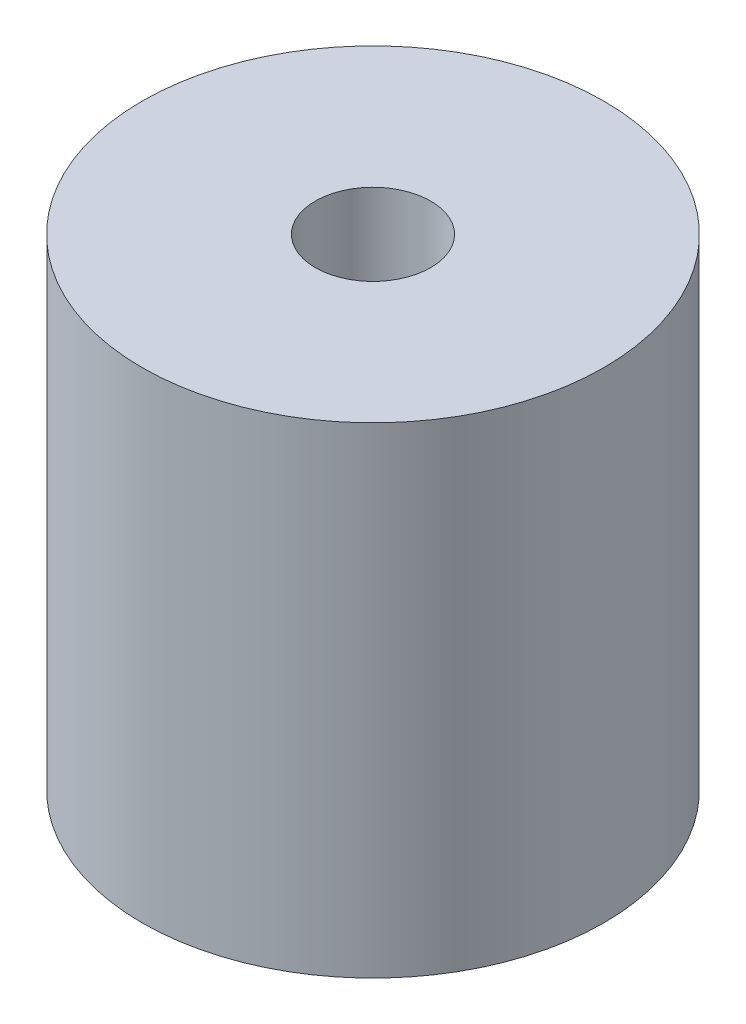
ISO-10303-21;
HEADER;
FILE_DESCRIPTION(('STEP AP214'),'2;1');
FILE_NAME('part.step','',(''),(''),'','','');
FILE_SCHEMA(('AUTOMOTIVE_DESIGN { 1 0 10303 214 1 1 1 1 }'));
ENDSEC;
DATA;
#1=APPLICATION_CONTEXT('core data for automotive mechanical design processes');
#2=APPLICATION_PROTOCOL_DEFINITION('international standard','automotive_design',2000,#1);
#3=PRODUCT_CONTEXT('',#1,'mechanical');
#4=PRODUCT('Part','Part','',(#3));
#5=PRODUCT_RELATED_PRODUCT_CATEGORY('part','',(#4));
#6=PRODUCT_DEFINITION_FORMATION('','',#4);
#7=PRODUCT_DEFINITION_CONTEXT('part definition',#1,'design');
#8=PRODUCT_DEFINITION('design','',#6,#7);
#9=PRODUCT_DEFINITION_SHAPE('','',#8);
#10=(LENGTH_UNIT() NAMED_UNIT(*) SI_UNIT(.MILLI.,.METRE.));
#11=(NAMED_UNIT(*) PLANE_ANGLE_UNIT() SI_UNIT($,.RADIAN.));
#12=(NAMED_UNIT(*) SI_UNIT($,.STERADIAN.) SOLID_ANGLE_UNIT());
#13=UNCERTAINTY_MEASURE_WITH_UNIT(LENGTH_MEASURE(1.E-05),#10,'distance_accuracy_value','');
#14=(GEOMETRIC_REPRESENTATION_CONTEXT(3) GLOBAL_UNCERTAINTY_ASSIGNED_CONTEXT((#13)) GLOBAL_UNIT_ASSIGNED_CONTEXT((#10,
#11,#12)) REPRESENTATION_CONTEXT('',''));
#15=CARTESIAN_POINT('',(0.,0.,0.));
#16=DIRECTION('',(0.,0.,1.));
#17=DIRECTION('',(1.,0.,0.));
#18=AXIS2_PLACEMENT_3D('',#15,#16,#17);
#19=CARTESIAN_POINT('',(0.,50.,0.));
#20=DIRECTION('',(0.,1.,0.));
#21=DIRECTION('',(0.,0.,1.));
#22=AXIS2_PLACEMENT_3D('',#19,#20,#21);
#23=PLANE('',#22);
#24=CARTESIAN_POINT('',(0.,50.,0.));
#25=DIRECTION('',(0.,1.,0.));
#26=DIRECTION('',(0.,0.,1.));
#27=AXIS2_PLACEMENT_3D('',#24,#25,#26);
#28=CIRCLE('',#27,24.);
#29=CARTESIAN_POINT('',(0.,50.,24.));
#30=VERTEX_POINT('',#29);
#31=EDGE_CURVE('E10',#30,#30,#28,.T.);
#32=ORIENTED_EDGE('',*,*,#31,.T.);
#33=EDGE_LOOP('',(#32));
#34=FACE_BOUND('',#33,.T.);
#35=CARTESIAN_POINT('',(0.,50.,0.));
#36=DIRECTION('',(0.,1.,0.));
#37=DIRECTION('',(0.,0.,1.));
#38=AXIS2_PLACEMENT_3D('',#35,#36,#37);
#39=CIRCLE('',#38,6.);
#40=CARTESIAN_POINT('',(0.,50.,6.));
#41=VERTEX_POINT('',#40);
#42=EDGE_CURVE('E41',#41,#41,#39,.T.);
#43=ORIENTED_EDGE('',*,*,#42,.F.);
#44=EDGE_LOOP('',(#43));
#45=FACE_BOUND('',#44,.T.);
#46=ADVANCED_FACE('F30',(#34,#45),#23,.T.);
#47=CARTESIAN_POINT('',(0.,0.,0.));
#48=DIRECTION('',(0.,1.,0.));
#49=DIRECTION('',(0.,0.,1.));
#50=AXIS2_PLACEMENT_3D('',#47,#48,#49);
#51=PLANE('',#50);
#52=CARTESIAN_POINT('',(0.,0.,0.));
#53=DIRECTION('',(0.,1.,0.));
#54=DIRECTION('',(0.,0.,1.));
#55=AXIS2_PLACEMENT_3D('',#52,#53,#54);
#56=CIRCLE('',#55,24.);
#57=CARTESIAN_POINT('',(0.,0.,24.));
#58=VERTEX_POINT('',#57);
#59=EDGE_CURVE('E34',#58,#58,#56,.T.);
#60=ORIENTED_EDGE('',*,*,#59,.F.);
#61=EDGE_LOOP('',(#60));
#62=FACE_BOUND('',#61,.T.);
#63=CARTESIAN_POINT('',(0.,0.,0.));
#64=DIRECTION('',(0.,1.,0.));
#65=DIRECTION('',(0.,0.,1.));
#66=AXIS2_PLACEMENT_3D('',#63,#64,#65);
#67=CIRCLE('',#66,6.);
#68=CARTESIAN_POINT('',(0.,0.,6.));
#69=VERTEX_POINT('',#68);
#70=EDGE_CURVE('E43',#69,#69,#67,.T.);
#71=ORIENTED_EDGE('',*,*,#70,.T.);
#72=EDGE_LOOP('',(#71));
#73=FACE_BOUND('',#72,.T.);
#74=ADVANCED_FACE('F53',(#62,#73),#51,.F.);
#75=CARTESIAN_POINT('',(0.,50.,0.));
#76=DIRECTION('',(0.,-1.,0.));
#77=DIRECTION('',(0.,0.,-1.));
#78=AXIS2_PLACEMENT_3D('',#75,#76,#77);
#79=CYLINDRICAL_SURFACE('',#78,24.);
#80=ORIENTED_EDGE('',*,*,#31,.F.);
#81=EDGE_LOOP('',(#80));
#82=FACE_BOUND('',#81,.T.);
#83=ORIENTED_EDGE('',*,*,#59,.T.);
#84=EDGE_LOOP('',(#83));
#85=FACE_BOUND('',#84,.T.);
#86=ADVANCED_FACE('F32',(#82,#85),#79,.T.);
#87=CARTESIAN_POINT('',(0.,50.,0.));
#88=DIRECTION('',(0.,-1.,0.));
#89=DIRECTION('',(0.,0.,-1.));
#90=AXIS2_PLACEMENT_3D('',#87,#88,#89);
#91=CYLINDRICAL_SURFACE('',#90,6.);
#92=ORIENTED_EDGE('',*,*,#42,.T.);
#93=EDGE_LOOP('',(#92));
#94=FACE_BOUND('',#93,.T.);
#95=ORIENTED_EDGE('',*,*,#70,.F.);
#96=EDGE_LOOP('',(#95));
#97=FACE_BOUND('',#96,.T.);
#98=ADVANCED_FACE('F49',(#94,#97),#91,.F.);
#99=CLOSED_SHELL('',(#46,#74,#86,#98));
#100=MANIFOLD_SOLID_BREP('B2',#99);
#101=ADVANCED_BREP_SHAPE_REPRESENTATION('',(#18,#100),#14);
#102=SHAPE_DEFINITION_REPRESENTATION(#9,#101);
ENDSEC;
END-ISO-10303-21;
